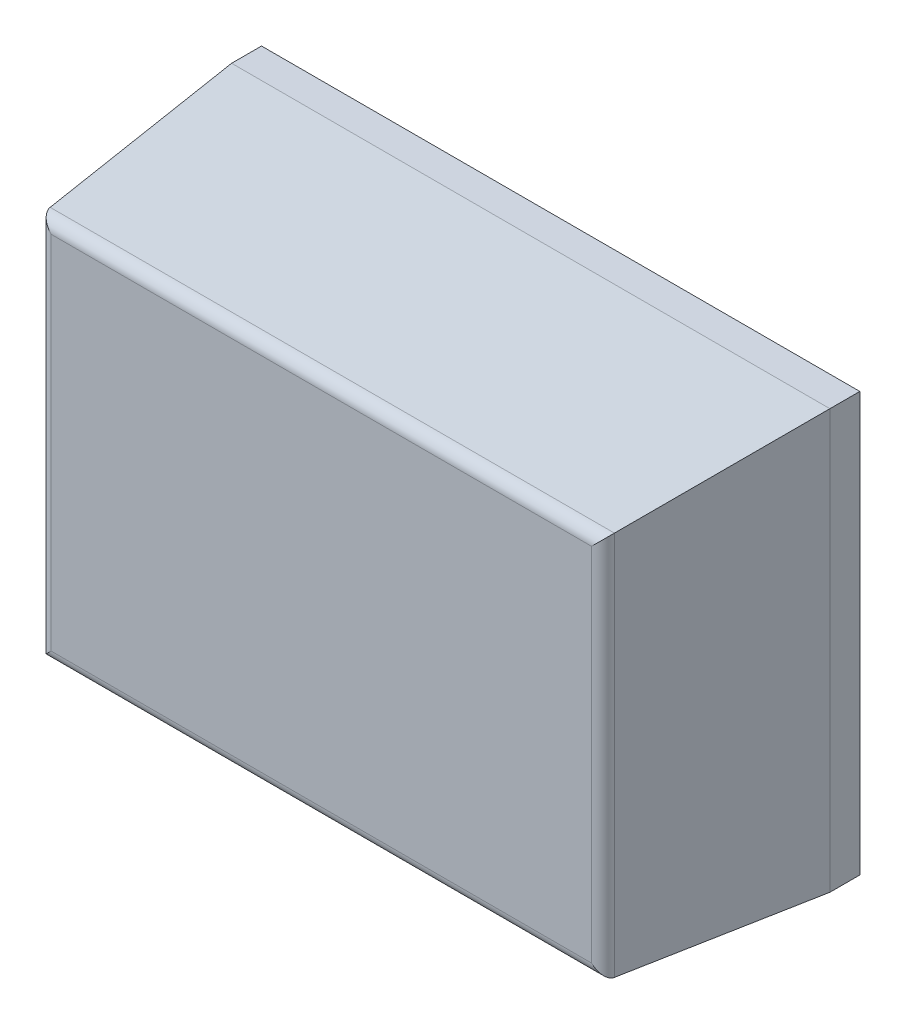
ISO-10303-21;
HEADER;
FILE_DESCRIPTION(('STEP AP214'),'2;1');
FILE_NAME('part.step','',(''),(''),'','','');
FILE_SCHEMA(('AUTOMOTIVE_DESIGN { 1 0 10303 214 1 1 1 1 }'));
ENDSEC;
DATA;
#1=APPLICATION_CONTEXT('core data for automotive mechanical design processes');
#2=APPLICATION_PROTOCOL_DEFINITION('international standard','automotive_design',2000,#1);
#3=PRODUCT_CONTEXT('',#1,'mechanical');
#4=PRODUCT('Part','Part','',(#3));
#5=PRODUCT_RELATED_PRODUCT_CATEGORY('part','',(#4));
#6=PRODUCT_DEFINITION_FORMATION('','',#4);
#7=PRODUCT_DEFINITION_CONTEXT('part definition',#1,'design');
#8=PRODUCT_DEFINITION('design','',#6,#7);
#9=PRODUCT_DEFINITION_SHAPE('','',#8);
#10=(LENGTH_UNIT() NAMED_UNIT(*) SI_UNIT(.MILLI.,.METRE.));
#11=(NAMED_UNIT(*) PLANE_ANGLE_UNIT() SI_UNIT($,.RADIAN.));
#12=(NAMED_UNIT(*) SI_UNIT($,.STERADIAN.) SOLID_ANGLE_UNIT());
#13=UNCERTAINTY_MEASURE_WITH_UNIT(LENGTH_MEASURE(1.E-05),#10,'distance_accuracy_value','');
#14=(GEOMETRIC_REPRESENTATION_CONTEXT(3) GLOBAL_UNCERTAINTY_ASSIGNED_CONTEXT((#13)) GLOBAL_UNIT_ASSIGNED_CONTEXT((#10,
#11,#12)) REPRESENTATION_CONTEXT('',''));
#15=CARTESIAN_POINT('',(0.,0.,0.));
#16=DIRECTION('',(0.,0.,1.));
#17=DIRECTION('',(1.,0.,0.));
#18=AXIS2_PLACEMENT_3D('',#15,#16,#17);
#19=CARTESIAN_POINT('',(-0.5,0.35,0.6));
#20=DIRECTION('',(0.,0.,1.));
#21=DIRECTION('',(1.,0.,0.));
#22=AXIS2_PLACEMENT_3D('',#19,#20,#21);
#23=PLANE('',#22);
#24=DIRECTION('',(-1.,0.,0.));
#25=VECTOR('',#24,1.);
#26=CARTESIAN_POINT('',(0.47,-0.301640950777,0.6));
#27=LINE('',#26,#25);
#28=CARTESIAN_POINT('',(0.451640950777,-0.301640950777,0.6));
#29=VERTEX_POINT('',#28);
#30=CARTESIAN_POINT('',(-0.451640950777,-0.301640950777,0.6));
#31=VERTEX_POINT('',#30);
#32=EDGE_CURVE('E46',#29,#31,#27,.T.);
#33=ORIENTED_EDGE('',*,*,#32,.F.);
#34=DIRECTION('',(0.,-1.,0.));
#35=VECTOR('',#34,1.);
#36=CARTESIAN_POINT('',(0.451640950777,0.32,0.6));
#37=LINE('',#36,#35);
#38=CARTESIAN_POINT('',(0.451640950777,0.301640950777,0.6));
#39=VERTEX_POINT('',#38);
#40=EDGE_CURVE('E98',#39,#29,#37,.T.);
#41=ORIENTED_EDGE('',*,*,#40,.F.);
#42=DIRECTION('',(1.,0.,0.));
#43=VECTOR('',#42,1.);
#44=CARTESIAN_POINT('',(-0.47,0.301640950777,0.6));
#45=LINE('',#44,#43);
#46=CARTESIAN_POINT('',(-0.451640950777,0.301640950777,0.6));
#47=VERTEX_POINT('',#46);
#48=EDGE_CURVE('E100',#47,#39,#45,.T.);
#49=ORIENTED_EDGE('',*,*,#48,.F.);
#50=DIRECTION('',(0.,1.,0.));
#51=VECTOR('',#50,1.);
#52=CARTESIAN_POINT('',(-0.451640950777,-0.32,0.6));
#53=LINE('',#52,#51);
#54=EDGE_CURVE('E11',#31,#47,#53,.T.);
#55=ORIENTED_EDGE('',*,*,#54,.F.);
#56=EDGE_LOOP('',(#33,#41,#49,#55));
#57=FACE_BOUND('',#56,.T.);
#58=ADVANCED_FACE('F17',(#57),#23,.T.);
#59=CARTESIAN_POINT('',(-0.451640950777,-0.32,0.58));
#60=DIRECTION('',(0.,1.,0.));
#61=DIRECTION('',(0.,0.,1.));
#62=AXIS2_PLACEMENT_3D('',#59,#60,#61);
#63=CYLINDRICAL_SURFACE('',#62,0.02);
#64=CARTESIAN_POINT('',(-0.471567883758,0.321567883758,0.581708022827));
#65=CARTESIAN_POINT('',(-0.470633907336,0.320633907336,0.592604414412999));
#66=CARTESIAN_POINT('',(-0.462577296673,0.312577296673,0.6));
#67=CARTESIAN_POINT('',(-0.451640950777,0.301640950777,0.6));
#68=(BOUNDED_CURVE() B_SPLINE_CURVE(3,(#64,#65,#66,#67),.UNSPECIFIED.,.F.,
.F.) B_SPLINE_CURVE_WITH_KNOTS((4,4),(3.227097947271,4.712388980385),
.UNSPECIFIED.) CURVE() GEOMETRIC_REPRESENTATION_ITEM() RATIONAL_B_SPLINE_CURVE((1.,
0.824454757864,0.824454757864,1.)) REPRESENTATION_ITEM(''));
#69=CARTESIAN_POINT('',(-0.471567883758,0.321567883758,0.581708022827));
#70=VERTEX_POINT('',#69);
#71=EDGE_CURVE('E112',#70,#47,#68,.T.);
#72=ORIENTED_EDGE('',*,*,#71,.F.);
#73=DIRECTION('',(0.,1.,0.));
#74=VECTOR('',#73,1.);
#75=CARTESIAN_POINT('',(-0.471567883758,-0.35,0.581708022827));
#76=LINE('',#75,#74);
#77=CARTESIAN_POINT('',(-0.471567883758,-0.321567883758,0.581708022827));
#78=VERTEX_POINT('',#77);
#79=EDGE_CURVE('E120',#78,#70,#76,.T.);
#80=ORIENTED_EDGE('',*,*,#79,.F.);
#81=CARTESIAN_POINT('',(-0.451640950777,-0.301640950777,0.6));
#82=CARTESIAN_POINT('',(-0.462577296673,-0.312577296673,0.6));
#83=CARTESIAN_POINT('',(-0.470633907336,-0.320633907336,0.592604414412999));
#84=CARTESIAN_POINT('',(-0.471567883758,-0.321567883758,0.581708022827));
#85=(BOUNDED_CURVE() B_SPLINE_CURVE(3,(#81,#82,#83,#84),.UNSPECIFIED.,.F.,
.F.) B_SPLINE_CURVE_WITH_KNOTS((4,4),(4.712388980385,6.197680013499),
.UNSPECIFIED.) CURVE() GEOMETRIC_REPRESENTATION_ITEM() RATIONAL_B_SPLINE_CURVE((1.,
0.824454757864,0.824454757864,1.)) REPRESENTATION_ITEM(''));
#86=EDGE_CURVE('E26',#31,#78,#85,.T.);
#87=ORIENTED_EDGE('',*,*,#86,.F.);
#88=ORIENTED_EDGE('',*,*,#54,.T.);
#89=EDGE_LOOP('',(#72,#80,#87,#88));
#90=FACE_BOUND('',#89,.T.);
#91=ADVANCED_FACE('F165',(#90),#63,.T.);
#92=CARTESIAN_POINT('',(0.47,-0.301640950777,0.58));
#93=DIRECTION('',(-1.,0.,0.));
#94=DIRECTION('',(0.,0.,1.));
#95=AXIS2_PLACEMENT_3D('',#92,#93,#94);
#96=CYLINDRICAL_SURFACE('',#95,0.02);
#97=DIRECTION('',(-1.,0.,0.));
#98=VECTOR('',#97,1.);
#99=CARTESIAN_POINT('',(0.5,-0.321567883758,0.581708022827));
#100=LINE('',#99,#98);
#101=CARTESIAN_POINT('',(0.471567883758,-0.321567883758,0.581708022827));
#102=VERTEX_POINT('',#101);
#103=EDGE_CURVE('E161',#102,#78,#100,.T.);
#104=ORIENTED_EDGE('',*,*,#103,.F.);
#105=CARTESIAN_POINT('',(0.451640950777,-0.301640950777,0.6));
#106=CARTESIAN_POINT('',(0.462577296673,-0.312577296673,0.6));
#107=CARTESIAN_POINT('',(0.470633907336,-0.320633907336,0.592604414412999));
#108=CARTESIAN_POINT('',(0.471567883758,-0.321567883758,0.581708022827));
#109=(BOUNDED_CURVE() B_SPLINE_CURVE(3,(#105,#106,#107,#108),.UNSPECIFIED.,.F.,
.F.) B_SPLINE_CURVE_WITH_KNOTS((4,4),(4.712388980385,6.197680013499),
.UNSPECIFIED.) CURVE() GEOMETRIC_REPRESENTATION_ITEM() RATIONAL_B_SPLINE_CURVE((1.,
0.824454757864,0.824454757864,1.)) REPRESENTATION_ITEM(''));
#110=EDGE_CURVE('E105',#29,#102,#109,.T.);
#111=ORIENTED_EDGE('',*,*,#110,.F.);
#112=ORIENTED_EDGE('',*,*,#32,.T.);
#113=ORIENTED_EDGE('',*,*,#86,.T.);
#114=EDGE_LOOP('',(#104,#111,#112,#113));
#115=FACE_BOUND('',#114,.T.);
#116=ADVANCED_FACE('F19',(#115),#96,.T.);
#117=CARTESIAN_POINT('',(0.451640950777,0.32,0.58));
#118=DIRECTION('',(0.,-1.,0.));
#119=DIRECTION('',(0.,0.,-1.));
#120=AXIS2_PLACEMENT_3D('',#117,#118,#119);
#121=CYLINDRICAL_SURFACE('',#120,0.02);
#122=DIRECTION('',(0.,-1.,0.));
#123=VECTOR('',#122,1.);
#124=CARTESIAN_POINT('',(0.471567883758,0.35,0.581708022827));
#125=LINE('',#124,#123);
#126=CARTESIAN_POINT('',(0.471567883758,0.321567883758,0.581708022827));
#127=VERTEX_POINT('',#126);
#128=EDGE_CURVE('E117',#127,#102,#125,.T.);
#129=ORIENTED_EDGE('',*,*,#128,.F.);
#130=CARTESIAN_POINT('',(0.451640950777,0.301640950777,0.6));
#131=CARTESIAN_POINT('',(0.462577296673,0.312577296673,0.6));
#132=CARTESIAN_POINT('',(0.470633907336,0.320633907336,0.592604414412999));
#133=CARTESIAN_POINT('',(0.471567883758,0.321567883758,0.581708022827));
#134=(BOUNDED_CURVE() B_SPLINE_CURVE(3,(#130,#131,#132,#133),.UNSPECIFIED.,.F.,
.F.) B_SPLINE_CURVE_WITH_KNOTS((4,4),(4.712388980385,6.197680013499),
.UNSPECIFIED.) CURVE() GEOMETRIC_REPRESENTATION_ITEM() RATIONAL_B_SPLINE_CURVE((1.,
0.824454757864,0.824454757864,1.)) REPRESENTATION_ITEM(''));
#135=EDGE_CURVE('E110',#39,#127,#134,.T.);
#136=ORIENTED_EDGE('',*,*,#135,.F.);
#137=ORIENTED_EDGE('',*,*,#40,.T.);
#138=ORIENTED_EDGE('',*,*,#110,.T.);
#139=EDGE_LOOP('',(#129,#136,#137,#138));
#140=FACE_BOUND('',#139,.T.);
#141=ADVANCED_FACE('F115',(#140),#121,.T.);
#142=CARTESIAN_POINT('',(-0.47,0.301640950777,0.58));
#143=DIRECTION('',(1.,0.,0.));
#144=DIRECTION('',(0.,0.,-1.));
#145=AXIS2_PLACEMENT_3D('',#142,#143,#144);
#146=CYLINDRICAL_SURFACE('',#145,0.02);
#147=ORIENTED_EDGE('',*,*,#135,.T.);
#148=DIRECTION('',(1.,0.,0.));
#149=VECTOR('',#148,1.);
#150=CARTESIAN_POINT('',(-0.5,0.321567883758,0.581708022827));
#151=LINE('',#150,#149);
#152=EDGE_CURVE('E192',#70,#127,#151,.T.);
#153=ORIENTED_EDGE('',*,*,#152,.F.);
#154=ORIENTED_EDGE('',*,*,#71,.T.);
#155=ORIENTED_EDGE('',*,*,#48,.T.);
#156=EDGE_LOOP('',(#147,#153,#154,#155));
#157=FACE_BOUND('',#156,.T.);
#158=ADVANCED_FACE('F108',(#157),#146,.T.);
#159=CARTESIAN_POINT('',(-0.485,-0.35,0.425));
#160=DIRECTION('',(-0.996346649041754,0.,0.0854011413463989));
#161=DIRECTION('',(0.,1.,0.));
#162=AXIS2_PLACEMENT_3D('',#159,#160,#161);
#163=PLANE('',#162);
#164=DIRECTION('',(0.,1.,0.));
#165=VECTOR('',#164,1.);
#166=CARTESIAN_POINT('',(-0.5,-0.35,0.25));
#167=LINE('',#166,#165);
#168=CARTESIAN_POINT('',(-0.5,-0.35,0.25));
#169=VERTEX_POINT('',#168);
#170=CARTESIAN_POINT('',(-0.5,0.35,0.25));
#171=VERTEX_POINT('',#170);
#172=EDGE_CURVE('E170',#169,#171,#167,.T.);
#173=ORIENTED_EDGE('',*,*,#172,.F.);
#174=DIRECTION('',(-0.0850914041686403,-0.0850914041695603,-0.992733048645537));
#175=VECTOR('',#174,1.);
#176=CARTESIAN_POINT('',(-0.471567883758,-0.321567883758,0.581708022827));
#177=LINE('',#176,#175);
#178=EDGE_CURVE('E129',#78,#169,#177,.T.);
#179=ORIENTED_EDGE('',*,*,#178,.F.);
#180=ORIENTED_EDGE('',*,*,#79,.T.);
#181=DIRECTION('',(0.0850914041686403,-0.0850914041695603,0.992733048645537));
#182=VECTOR('',#181,1.);
#183=CARTESIAN_POINT('',(-0.5,0.35,0.25));
#184=LINE('',#183,#182);
#185=EDGE_CURVE('E187',#171,#70,#184,.T.);
#186=ORIENTED_EDGE('',*,*,#185,.F.);
#187=EDGE_LOOP('',(#173,#179,#180,#186));
#188=FACE_BOUND('',#187,.T.);
#189=ADVANCED_FACE('F168',(#188),#163,.T.);
#190=CARTESIAN_POINT('',(0.5,-0.335,0.425));
#191=DIRECTION('',(0.,-0.996346649041754,0.0854011413463989));
#192=DIRECTION('',(-1.,0.,0.));
#193=AXIS2_PLACEMENT_3D('',#190,#191,#192);
#194=PLANE('',#193);
#195=DIRECTION('',(-1.,0.,0.));
#196=VECTOR('',#195,1.);
#197=CARTESIAN_POINT('',(0.5,-0.35,0.25));
#198=LINE('',#197,#196);
#199=CARTESIAN_POINT('',(0.5,-0.35,0.25));
#200=VERTEX_POINT('',#199);
#201=EDGE_CURVE('E188',#200,#169,#198,.T.);
#202=ORIENTED_EDGE('',*,*,#201,.F.);
#203=DIRECTION('',(0.0850914041695603,-0.0850914041686403,-0.992733048645537));
#204=VECTOR('',#203,1.);
#205=CARTESIAN_POINT('',(0.471567883758,-0.321567883758,0.581708022827));
#206=LINE('',#205,#204);
#207=EDGE_CURVE('E177',#102,#200,#206,.T.);
#208=ORIENTED_EDGE('',*,*,#207,.F.);
#209=ORIENTED_EDGE('',*,*,#103,.T.);
#210=ORIENTED_EDGE('',*,*,#178,.T.);
#211=EDGE_LOOP('',(#202,#208,#209,#210));
#212=FACE_BOUND('',#211,.T.);
#213=ADVANCED_FACE('F176',(#212),#194,.T.);
#214=CARTESIAN_POINT('',(0.485,0.35,0.425));
#215=DIRECTION('',(0.996346649041754,0.,0.0854011413463989));
#216=DIRECTION('',(0.,-1.,0.));
#217=AXIS2_PLACEMENT_3D('',#214,#215,#216);
#218=PLANE('',#217);
#219=DIRECTION('',(0.,-1.,0.));
#220=VECTOR('',#219,1.);
#221=CARTESIAN_POINT('',(0.5,0.35,0.25));
#222=LINE('',#221,#220);
#223=CARTESIAN_POINT('',(0.5,0.35,0.25));
#224=VERTEX_POINT('',#223);
#225=EDGE_CURVE('E196',#224,#200,#222,.T.);
#226=ORIENTED_EDGE('',*,*,#225,.F.);
#227=DIRECTION('',(0.0850914041686403,0.0850914041695603,-0.992733048645537));
#228=VECTOR('',#227,1.);
#229=CARTESIAN_POINT('',(0.471567883758,0.321567883758,0.581708022827));
#230=LINE('',#229,#228);
#231=EDGE_CURVE('E203',#127,#224,#230,.T.);
#232=ORIENTED_EDGE('',*,*,#231,.F.);
#233=ORIENTED_EDGE('',*,*,#128,.T.);
#234=ORIENTED_EDGE('',*,*,#207,.T.);
#235=EDGE_LOOP('',(#226,#232,#233,#234));
#236=FACE_BOUND('',#235,.T.);
#237=ADVANCED_FACE('F281',(#236),#218,.T.);
#238=CARTESIAN_POINT('',(-0.5,0.335,0.425));
#239=DIRECTION('',(0.,0.996346649041754,0.0854011413463989));
#240=DIRECTION('',(1.,0.,0.));
#241=AXIS2_PLACEMENT_3D('',#238,#239,#240);
#242=PLANE('',#241);
#243=DIRECTION('',(1.,0.,0.));
#244=VECTOR('',#243,1.);
#245=CARTESIAN_POINT('',(-0.5,0.35,0.25));
#246=LINE('',#245,#244);
#247=EDGE_CURVE('E208',#171,#224,#246,.T.);
#248=ORIENTED_EDGE('',*,*,#247,.F.);
#249=ORIENTED_EDGE('',*,*,#185,.T.);
#250=ORIENTED_EDGE('',*,*,#152,.T.);
#251=ORIENTED_EDGE('',*,*,#231,.T.);
#252=EDGE_LOOP('',(#248,#249,#250,#251));
#253=FACE_BOUND('',#252,.T.);
#254=ADVANCED_FACE('F289',(#253),#242,.T.);
#255=CARTESIAN_POINT('',(-0.5,-0.35,0.2));
#256=DIRECTION('',(-1.,0.,0.));
#257=DIRECTION('',(0.,0.,1.));
#258=AXIS2_PLACEMENT_3D('',#255,#256,#257);
#259=PLANE('',#258);
#260=DIRECTION('',(0.,0.,1.));
#261=VECTOR('',#260,1.);
#262=CARTESIAN_POINT('',(-0.5,0.35,0.2));
#263=LINE('',#262,#261);
#264=CARTESIAN_POINT('',(-0.5,0.35,0.2));
#265=VERTEX_POINT('',#264);
#266=EDGE_CURVE('E204',#265,#171,#263,.T.);
#267=ORIENTED_EDGE('',*,*,#266,.F.);
#268=DIRECTION('',(0.,-1.,0.));
#269=VECTOR('',#268,1.);
#270=CARTESIAN_POINT('',(-0.5,0.35,0.2));
#271=LINE('',#270,#269);
#272=CARTESIAN_POINT('',(-0.5,-0.35,0.2));
#273=VERTEX_POINT('',#272);
#274=EDGE_CURVE('E222',#265,#273,#271,.T.);
#275=ORIENTED_EDGE('',*,*,#274,.T.);
#276=DIRECTION('',(0.,0.,-1.));
#277=VECTOR('',#276,1.);
#278=CARTESIAN_POINT('',(-0.5,-0.35,0.2));
#279=LINE('',#278,#277);
#280=EDGE_CURVE('E195',#169,#273,#279,.T.);
#281=ORIENTED_EDGE('',*,*,#280,.F.);
#282=ORIENTED_EDGE('',*,*,#172,.T.);
#283=EDGE_LOOP('',(#267,#275,#281,#282));
#284=FACE_BOUND('',#283,.T.);
#285=ADVANCED_FACE('F298',(#284),#259,.T.);
#286=CARTESIAN_POINT('',(0.5,-0.35,0.2));
#287=DIRECTION('',(0.,-1.,0.));
#288=DIRECTION('',(0.,0.,-1.));
#289=AXIS2_PLACEMENT_3D('',#286,#287,#288);
#290=PLANE('',#289);
#291=ORIENTED_EDGE('',*,*,#280,.T.);
#292=DIRECTION('',(1.,0.,0.));
#293=VECTOR('',#292,1.);
#294=CARTESIAN_POINT('',(-0.5,-0.35,0.2));
#295=LINE('',#294,#293);
#296=CARTESIAN_POINT('',(0.5,-0.35,0.2));
#297=VERTEX_POINT('',#296);
#298=EDGE_CURVE('E229',#273,#297,#295,.T.);
#299=ORIENTED_EDGE('',*,*,#298,.T.);
#300=DIRECTION('',(0.,0.,-1.));
#301=VECTOR('',#300,1.);
#302=CARTESIAN_POINT('',(0.5,-0.35,0.2));
#303=LINE('',#302,#301);
#304=EDGE_CURVE('E200',#200,#297,#303,.T.);
#305=ORIENTED_EDGE('',*,*,#304,.F.);
#306=ORIENTED_EDGE('',*,*,#201,.T.);
#307=EDGE_LOOP('',(#291,#299,#305,#306));
#308=FACE_BOUND('',#307,.T.);
#309=ADVANCED_FACE('F304',(#308),#290,.T.);
#310=CARTESIAN_POINT('',(0.5,0.35,0.2));
#311=DIRECTION('',(1.,0.,0.));
#312=DIRECTION('',(0.,1.,0.));
#313=AXIS2_PLACEMENT_3D('',#310,#311,#312);
#314=PLANE('',#313);
#315=ORIENTED_EDGE('',*,*,#304,.T.);
#316=DIRECTION('',(0.,1.,0.));
#317=VECTOR('',#316,1.);
#318=CARTESIAN_POINT('',(0.5,0.35,0.2));
#319=LINE('',#318,#317);
#320=CARTESIAN_POINT('',(0.5,0.35,0.2));
#321=VERTEX_POINT('',#320);
#322=EDGE_CURVE('E235',#297,#321,#319,.T.);
#323=ORIENTED_EDGE('',*,*,#322,.T.);
#324=DIRECTION('',(0.,0.,-1.));
#325=VECTOR('',#324,1.);
#326=CARTESIAN_POINT('',(0.5,0.35,0.2));
#327=LINE('',#326,#325);
#328=EDGE_CURVE('E209',#224,#321,#327,.T.);
#329=ORIENTED_EDGE('',*,*,#328,.F.);
#330=ORIENTED_EDGE('',*,*,#225,.T.);
#331=EDGE_LOOP('',(#315,#323,#329,#330));
#332=FACE_BOUND('',#331,.T.);
#333=ADVANCED_FACE('F245',(#332),#314,.T.);
#334=CARTESIAN_POINT('',(-0.5,0.35,0.2));
#335=DIRECTION('',(0.,1.,0.));
#336=DIRECTION('',(1.,0.,0.));
#337=AXIS2_PLACEMENT_3D('',#334,#335,#336);
#338=PLANE('',#337);
#339=ORIENTED_EDGE('',*,*,#328,.T.);
#340=DIRECTION('',(-1.,0.,0.));
#341=VECTOR('',#340,1.);
#342=CARTESIAN_POINT('',(-0.5,0.35,0.2));
#343=LINE('',#342,#341);
#344=EDGE_CURVE('E215',#321,#265,#343,.T.);
#345=ORIENTED_EDGE('',*,*,#344,.T.);
#346=ORIENTED_EDGE('',*,*,#266,.T.);
#347=ORIENTED_EDGE('',*,*,#247,.T.);
#348=EDGE_LOOP('',(#339,#345,#346,#347));
#349=FACE_BOUND('',#348,.T.);
#350=ADVANCED_FACE('F324',(#349),#338,.T.);
#351=CARTESIAN_POINT('',(-0.5,0.35,0.2));
#352=DIRECTION('',(0.,0.,1.));
#353=DIRECTION('',(1.,0.,0.));
#354=AXIS2_PLACEMENT_3D('',#351,#352,#353);
#355=PLANE('',#354);
#356=ORIENTED_EDGE('',*,*,#322,.F.);
#357=ORIENTED_EDGE('',*,*,#298,.F.);
#358=ORIENTED_EDGE('',*,*,#274,.F.);
#359=ORIENTED_EDGE('',*,*,#344,.F.);
#360=EDGE_LOOP('',(#356,#357,#358,#359));
#361=FACE_BOUND('',#360,.T.);
#362=ADVANCED_FACE('F250',(#361),#355,.F.);
#363=CLOSED_SHELL('',(#58,#91,#116,#141,#158,#189,#213,#237,#254,#285,#309,#333,#350,#362));
#364=MANIFOLD_SOLID_BREP('B1',#363);
#365=ADVANCED_BREP_SHAPE_REPRESENTATION('',(#18,#364),#14);
#366=SHAPE_DEFINITION_REPRESENTATION(#9,#365);
ENDSEC;
END-ISO-10303-21;
